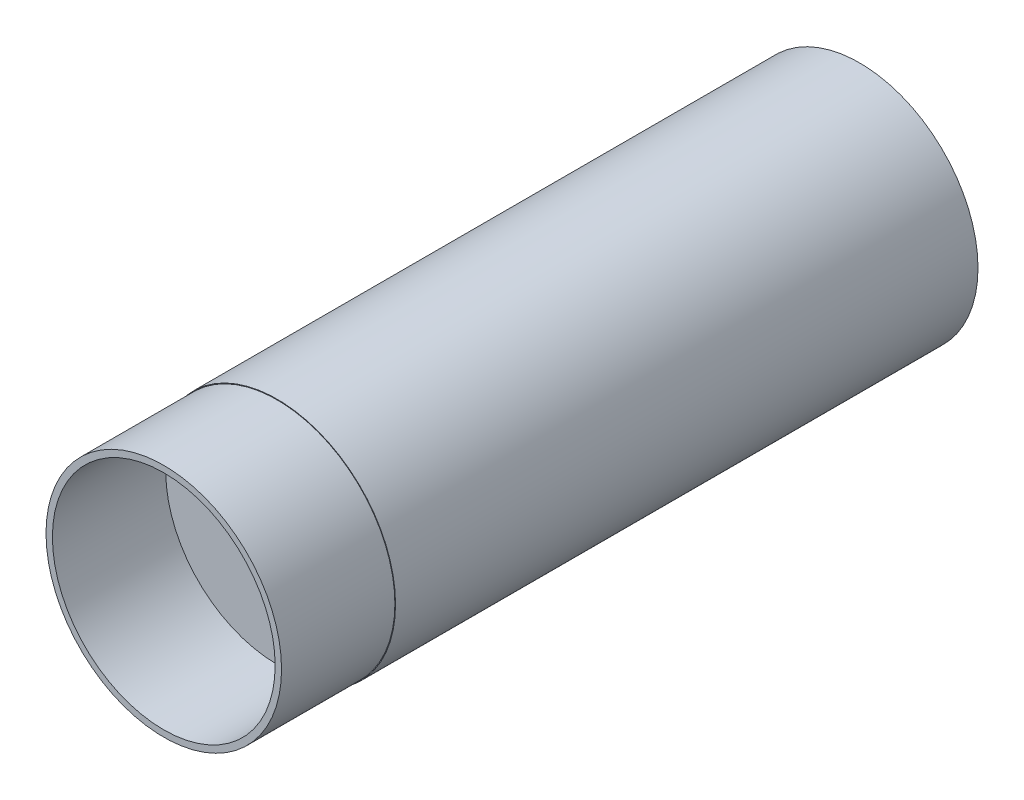
ISO-10303-21;
HEADER;
FILE_DESCRIPTION(('STEP AP214'),'2;1');
FILE_NAME('part.step','',(''),(''),'','','');
FILE_SCHEMA(('AUTOMOTIVE_DESIGN { 1 0 10303 214 1 1 1 1 }'));
ENDSEC;
DATA;
#1=APPLICATION_CONTEXT('core data for automotive mechanical design processes');
#2=APPLICATION_PROTOCOL_DEFINITION('international standard','automotive_design',2000,#1);
#3=PRODUCT_CONTEXT('',#1,'mechanical');
#4=PRODUCT('Part','Part','',(#3));
#5=PRODUCT_RELATED_PRODUCT_CATEGORY('part','',(#4));
#6=PRODUCT_DEFINITION_FORMATION('','',#4);
#7=PRODUCT_DEFINITION_CONTEXT('part definition',#1,'design');
#8=PRODUCT_DEFINITION('design','',#6,#7);
#9=PRODUCT_DEFINITION_SHAPE('','',#8);
#10=(LENGTH_UNIT() NAMED_UNIT(*) SI_UNIT(.MILLI.,.METRE.));
#11=(NAMED_UNIT(*) PLANE_ANGLE_UNIT() SI_UNIT($,.RADIAN.));
#12=(NAMED_UNIT(*) SI_UNIT($,.STERADIAN.) SOLID_ANGLE_UNIT());
#13=UNCERTAINTY_MEASURE_WITH_UNIT(LENGTH_MEASURE(1.E-05),#10,'distance_accuracy_value','');
#14=(GEOMETRIC_REPRESENTATION_CONTEXT(3) GLOBAL_UNCERTAINTY_ASSIGNED_CONTEXT((#13)) GLOBAL_UNIT_ASSIGNED_CONTEXT((#10,
#11,#12)) REPRESENTATION_CONTEXT('',''));
#15=CARTESIAN_POINT('',(0.,0.,0.));
#16=DIRECTION('',(0.,0.,1.));
#17=DIRECTION('',(1.,0.,0.));
#18=AXIS2_PLACEMENT_3D('',#15,#16,#17);
#19=CARTESIAN_POINT('',(0.,0.,17.71));
#20=DIRECTION('',(0.,0.,-1.));
#21=DIRECTION('',(-1.,0.,0.));
#22=AXIS2_PLACEMENT_3D('',#19,#20,#21);
#23=CYLINDRICAL_SURFACE('',#22,17.4);
#24=CARTESIAN_POINT('',(0.,0.,17.71));
#25=DIRECTION('',(0.,0.,1.));
#26=DIRECTION('',(1.,0.,0.));
#27=AXIS2_PLACEMENT_3D('',#24,#25,#26);
#28=CIRCLE('',#27,17.4);
#29=CARTESIAN_POINT('',(17.4,0.,17.71));
#30=VERTEX_POINT('',#29);
#31=EDGE_CURVE('E40',#30,#30,#28,.T.);
#32=ORIENTED_EDGE('',*,*,#31,.T.);
#33=EDGE_LOOP('',(#32));
#34=FACE_BOUND('',#33,.T.);
#35=CARTESIAN_POINT('',(0.,0.,0.));
#36=DIRECTION('',(0.,0.,1.));
#37=DIRECTION('',(1.,0.,0.));
#38=AXIS2_PLACEMENT_3D('',#35,#36,#37);
#39=CIRCLE('',#38,17.4);
#40=CARTESIAN_POINT('',(17.4,0.,0.));
#41=VERTEX_POINT('',#40);
#42=EDGE_CURVE('E45',#41,#41,#39,.T.);
#43=ORIENTED_EDGE('',*,*,#42,.F.);
#44=EDGE_LOOP('',(#43));
#45=FACE_BOUND('',#44,.T.);
#46=ADVANCED_FACE('F33',(#34,#45),#23,.F.);
#47=CARTESIAN_POINT('',(0.,0.,17.71));
#48=DIRECTION('',(0.,0.,-1.));
#49=DIRECTION('',(-1.,0.,0.));
#50=AXIS2_PLACEMENT_3D('',#47,#48,#49);
#51=CYLINDRICAL_SURFACE('',#50,18.4);
#52=CARTESIAN_POINT('',(0.,0.,17.71));
#53=DIRECTION('',(0.,0.,1.));
#54=DIRECTION('',(1.,0.,0.));
#55=AXIS2_PLACEMENT_3D('',#52,#53,#54);
#56=CIRCLE('',#55,18.4);
#57=CARTESIAN_POINT('',(18.4,0.,17.71));
#58=VERTEX_POINT('',#57);
#59=EDGE_CURVE('E10',#58,#58,#56,.T.);
#60=ORIENTED_EDGE('',*,*,#59,.F.);
#61=EDGE_LOOP('',(#60));
#62=FACE_BOUND('',#61,.T.);
#63=CARTESIAN_POINT('',(0.,0.,0.));
#64=DIRECTION('',(0.,0.,1.));
#65=DIRECTION('',(1.,0.,0.));
#66=AXIS2_PLACEMENT_3D('',#63,#64,#65);
#67=CIRCLE('',#66,18.4);
#68=CARTESIAN_POINT('',(18.4,0.,0.));
#69=VERTEX_POINT('',#68);
#70=EDGE_CURVE('E36',#69,#69,#67,.T.);
#71=ORIENTED_EDGE('',*,*,#70,.T.);
#72=EDGE_LOOP('',(#71));
#73=FACE_BOUND('',#72,.T.);
#74=ADVANCED_FACE('F79',(#62,#73),#51,.T.);
#75=CARTESIAN_POINT('',(0.,0.,17.71));
#76=DIRECTION('',(0.,0.,1.));
#77=DIRECTION('',(1.,0.,0.));
#78=AXIS2_PLACEMENT_3D('',#75,#76,#77);
#79=PLANE('',#78);
#80=ORIENTED_EDGE('',*,*,#31,.F.);
#81=EDGE_LOOP('',(#80));
#82=FACE_BOUND('',#81,.T.);
#83=ORIENTED_EDGE('',*,*,#59,.T.);
#84=EDGE_LOOP('',(#83));
#85=FACE_BOUND('',#84,.T.);
#86=ADVANCED_FACE('F84',(#82,#85),#79,.T.);
#87=CARTESIAN_POINT('',(0.,0.,0.));
#88=DIRECTION('',(0.,0.,1.));
#89=DIRECTION('',(1.,0.,0.));
#90=AXIS2_PLACEMENT_3D('',#87,#88,#89);
#91=PLANE('',#90);
#92=ORIENTED_EDGE('',*,*,#70,.F.);
#93=EDGE_LOOP('',(#92));
#94=FACE_BOUND('',#93,.T.);
#95=CARTESIAN_POINT('',(0.,0.,0.));
#96=DIRECTION('',(0.,0.,1.));
#97=DIRECTION('',(1.,0.,0.));
#98=AXIS2_PLACEMENT_3D('',#95,#96,#97);
#99=CIRCLE('',#98,18.5);
#100=CARTESIAN_POINT('',(18.5,0.,0.));
#101=VERTEX_POINT('',#100);
#102=EDGE_CURVE('E56',#101,#101,#99,.T.);
#103=ORIENTED_EDGE('',*,*,#102,.T.);
#104=EDGE_LOOP('',(#103));
#105=FACE_BOUND('',#104,.T.);
#106=ADVANCED_FACE('F63',(#94,#105),#91,.T.);
#107=CARTESIAN_POINT('',(0.,0.,-91.));
#108=DIRECTION('',(0.,0.,1.));
#109=DIRECTION('',(1.,0.,0.));
#110=AXIS2_PLACEMENT_3D('',#107,#108,#109);
#111=PLANE('',#110);
#112=CARTESIAN_POINT('',(0.,0.,-91.));
#113=DIRECTION('',(0.,0.,1.));
#114=DIRECTION('',(1.,0.,0.));
#115=AXIS2_PLACEMENT_3D('',#112,#113,#114);
#116=CIRCLE('',#115,18.5);
#117=CARTESIAN_POINT('',(18.5,0.,-91.));
#118=VERTEX_POINT('',#117);
#119=EDGE_CURVE('E52',#118,#118,#116,.T.);
#120=ORIENTED_EDGE('',*,*,#119,.F.);
#121=EDGE_LOOP('',(#120));
#122=FACE_BOUND('',#121,.T.);
#123=ADVANCED_FACE('F68',(#122),#111,.F.);
#124=CARTESIAN_POINT('',(0.,0.,-91.));
#125=DIRECTION('',(0.,0.,1.));
#126=DIRECTION('',(1.,0.,0.));
#127=AXIS2_PLACEMENT_3D('',#124,#125,#126);
#128=CYLINDRICAL_SURFACE('',#127,18.5);
#129=ORIENTED_EDGE('',*,*,#119,.T.);
#130=EDGE_LOOP('',(#129));
#131=FACE_BOUND('',#130,.T.);
#132=ORIENTED_EDGE('',*,*,#102,.F.);
#133=EDGE_LOOP('',(#132));
#134=FACE_BOUND('',#133,.T.);
#135=ADVANCED_FACE('F65',(#131,#134),#128,.T.);
#136=ORIENTED_EDGE('',*,*,#42,.T.);
#137=EDGE_LOOP('',(#136));
#138=FACE_BOUND('',#137,.T.);
#139=ADVANCED_FACE('F67',(#138),#91,.T.);
#140=CLOSED_SHELL('',(#46,#74,#86,#106,#123,#135,#139));
#141=MANIFOLD_SOLID_BREP('B2',#140);
#142=ADVANCED_BREP_SHAPE_REPRESENTATION('',(#18,#141),#14);
#143=SHAPE_DEFINITION_REPRESENTATION(#9,#142);
ENDSEC;
END-ISO-10303-21;
